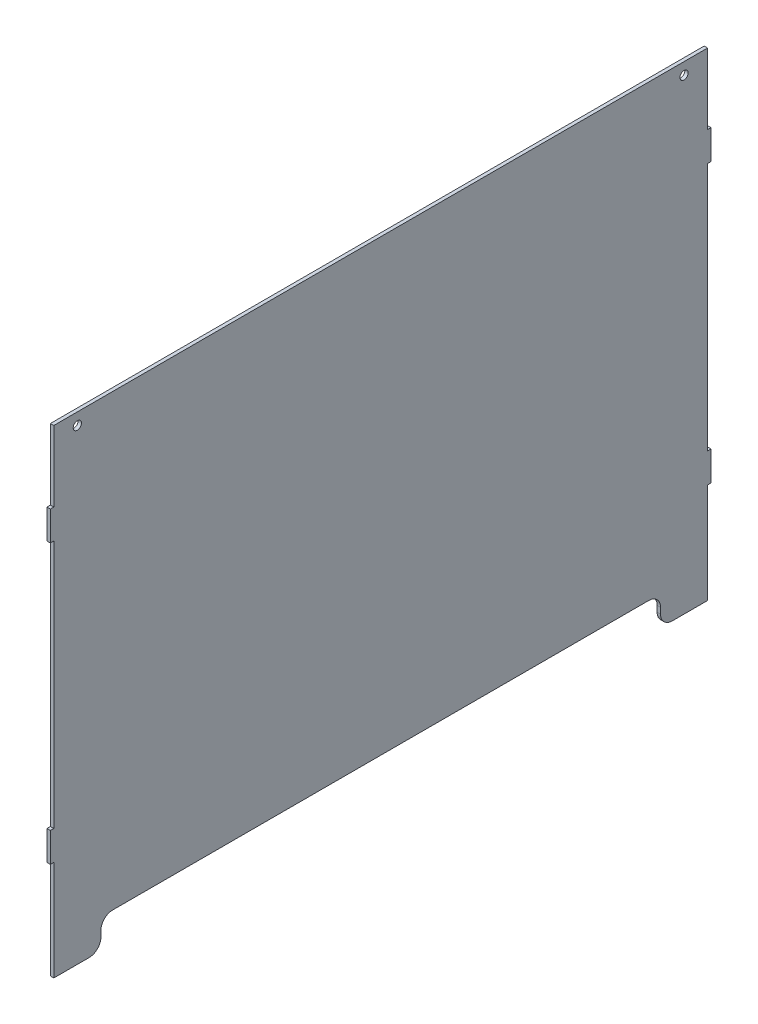
ISO-10303-21;
HEADER;
FILE_DESCRIPTION(('STEP AP214'),'2;1');
FILE_NAME('part.step','',(''),(''),'','','');
FILE_SCHEMA(('AUTOMOTIVE_DESIGN { 1 0 10303 214 1 1 1 1 }'));
ENDSEC;
DATA;
#1=APPLICATION_CONTEXT('core data for automotive mechanical design processes');
#2=APPLICATION_PROTOCOL_DEFINITION('international standard','automotive_design',2000,#1);
#3=PRODUCT_CONTEXT('',#1,'mechanical');
#4=PRODUCT('Part','Part','',(#3));
#5=PRODUCT_RELATED_PRODUCT_CATEGORY('part','',(#4));
#6=PRODUCT_DEFINITION_FORMATION('','',#4);
#7=PRODUCT_DEFINITION_CONTEXT('part definition',#1,'design');
#8=PRODUCT_DEFINITION('design','',#6,#7);
#9=PRODUCT_DEFINITION_SHAPE('','',#8);
#10=(LENGTH_UNIT() NAMED_UNIT(*) SI_UNIT(.MILLI.,.METRE.));
#11=(NAMED_UNIT(*) PLANE_ANGLE_UNIT() SI_UNIT($,.RADIAN.));
#12=(NAMED_UNIT(*) SI_UNIT($,.STERADIAN.) SOLID_ANGLE_UNIT());
#13=UNCERTAINTY_MEASURE_WITH_UNIT(LENGTH_MEASURE(1.E-05),#10,'distance_accuracy_value','');
#14=(GEOMETRIC_REPRESENTATION_CONTEXT(3) GLOBAL_UNCERTAINTY_ASSIGNED_CONTEXT((#13)) GLOBAL_UNIT_ASSIGNED_CONTEXT((#10,
#11,#12)) REPRESENTATION_CONTEXT('',''));
#15=CARTESIAN_POINT('',(0.,0.,0.));
#16=DIRECTION('',(0.,0.,1.));
#17=DIRECTION('',(1.,0.,0.));
#18=AXIS2_PLACEMENT_3D('',#15,#16,#17);
#19=CARTESIAN_POINT('',(2.9,143.2,-277.65));
#20=DIRECTION('',(0.,0.,1.));
#21=DIRECTION('',(1.,0.,0.));
#22=AXIS2_PLACEMENT_3D('',#19,#20,#21);
#23=PLANE('',#22);
#24=DIRECTION('',(0.,1.,0.));
#25=VECTOR('',#24,1.);
#26=CARTESIAN_POINT('',(0.,143.2,-277.65));
#27=LINE('',#26,#25);
#28=CARTESIAN_POINT('',(0.,143.2,-277.65));
#29=VERTEX_POINT('',#28);
#30=CARTESIAN_POINT('',(0.,203.2,-277.65));
#31=VERTEX_POINT('',#30);
#32=EDGE_CURVE('E252',#29,#31,#27,.T.);
#33=ORIENTED_EDGE('',*,*,#32,.T.);
#34=DIRECTION('',(-1.,0.,0.));
#35=VECTOR('',#34,1.);
#36=CARTESIAN_POINT('',(2.9,203.2,-277.65));
#37=LINE('',#36,#35);
#38=CARTESIAN_POINT('',(2.9,203.2,-277.65));
#39=VERTEX_POINT('',#38);
#40=EDGE_CURVE('E11',#39,#31,#37,.T.);
#41=ORIENTED_EDGE('',*,*,#40,.F.);
#42=DIRECTION('',(0.,1.,0.));
#43=VECTOR('',#42,1.);
#44=CARTESIAN_POINT('',(2.9,143.2,-277.65));
#45=LINE('',#44,#43);
#46=CARTESIAN_POINT('',(2.9,143.2,-277.65));
#47=VERTEX_POINT('',#46);
#48=EDGE_CURVE('E307',#47,#39,#45,.T.);
#49=ORIENTED_EDGE('',*,*,#48,.F.);
#50=DIRECTION('',(-1.,0.,0.));
#51=VECTOR('',#50,1.);
#52=CARTESIAN_POINT('',(2.9,143.2,-277.65));
#53=LINE('',#52,#51);
#54=EDGE_CURVE('E248',#47,#29,#53,.T.);
#55=ORIENTED_EDGE('',*,*,#54,.T.);
#56=EDGE_LOOP('',(#33,#41,#49,#55));
#57=FACE_BOUND('',#56,.T.);
#58=ADVANCED_FACE('F36',(#57),#23,.F.);
#59=CARTESIAN_POINT('',(2.9,203.2,277.65));
#60=DIRECTION('',(0.,-1.,0.));
#61=DIRECTION('',(0.,0.,-1.));
#62=AXIS2_PLACEMENT_3D('',#59,#60,#61);
#63=PLANE('',#62);
#64=DIRECTION('',(0.,0.,1.));
#65=VECTOR('',#64,1.);
#66=CARTESIAN_POINT('',(0.,203.2,277.65));
#67=LINE('',#66,#65);
#68=CARTESIAN_POINT('',(0.,203.2,277.65));
#69=VERTEX_POINT('',#68);
#70=EDGE_CURVE('E255',#31,#69,#67,.T.);
#71=ORIENTED_EDGE('',*,*,#70,.T.);
#72=DIRECTION('',(-1.,0.,0.));
#73=VECTOR('',#72,1.);
#74=CARTESIAN_POINT('',(2.9,203.2,277.65));
#75=LINE('',#74,#73);
#76=CARTESIAN_POINT('',(2.9,203.2,277.65));
#77=VERTEX_POINT('',#76);
#78=EDGE_CURVE('E44',#77,#69,#75,.T.);
#79=ORIENTED_EDGE('',*,*,#78,.F.);
#80=DIRECTION('',(0.,0.,1.));
#81=VECTOR('',#80,1.);
#82=CARTESIAN_POINT('',(2.9,203.2,277.65));
#83=LINE('',#82,#81);
#84=EDGE_CURVE('E155',#39,#77,#83,.T.);
#85=ORIENTED_EDGE('',*,*,#84,.F.);
#86=ORIENTED_EDGE('',*,*,#40,.T.);
#87=EDGE_LOOP('',(#71,#79,#85,#86));
#88=FACE_BOUND('',#87,.T.);
#89=ADVANCED_FACE('F466',(#88),#63,.F.);
#90=CARTESIAN_POINT('',(2.9,143.2,277.65));
#91=DIRECTION('',(0.,0.,-1.));
#92=DIRECTION('',(-1.,0.,0.));
#93=AXIS2_PLACEMENT_3D('',#90,#91,#92);
#94=PLANE('',#93);
#95=DIRECTION('',(0.,-1.,0.));
#96=VECTOR('',#95,1.);
#97=CARTESIAN_POINT('',(0.,143.2,277.65));
#98=LINE('',#97,#96);
#99=CARTESIAN_POINT('',(0.,143.2,277.65));
#100=VERTEX_POINT('',#99);
#101=EDGE_CURVE('E258',#69,#100,#98,.T.);
#102=ORIENTED_EDGE('',*,*,#101,.T.);
#103=DIRECTION('',(-1.,0.,0.));
#104=VECTOR('',#103,1.);
#105=CARTESIAN_POINT('',(2.9,143.2,277.65));
#106=LINE('',#105,#104);
#107=CARTESIAN_POINT('',(2.9,143.2,277.65));
#108=VERTEX_POINT('',#107);
#109=EDGE_CURVE('E374',#108,#100,#106,.T.);
#110=ORIENTED_EDGE('',*,*,#109,.F.);
#111=DIRECTION('',(0.,-1.,0.));
#112=VECTOR('',#111,1.);
#113=CARTESIAN_POINT('',(2.9,143.2,277.65));
#114=LINE('',#113,#112);
#115=EDGE_CURVE('E382',#77,#108,#114,.T.);
#116=ORIENTED_EDGE('',*,*,#115,.F.);
#117=ORIENTED_EDGE('',*,*,#78,.T.);
#118=EDGE_LOOP('',(#102,#110,#116,#117));
#119=FACE_BOUND('',#118,.T.);
#120=ADVANCED_FACE('F380',(#119),#94,.F.);
#121=CARTESIAN_POINT('',(2.9,143.2,277.65));
#122=DIRECTION('',(0.,-1.,0.));
#123=DIRECTION('',(0.,0.,-1.));
#124=AXIS2_PLACEMENT_3D('',#121,#122,#123);
#125=PLANE('',#124);
#126=DIRECTION('',(0.,0.,1.));
#127=VECTOR('',#126,1.);
#128=CARTESIAN_POINT('',(0.,143.2,277.65));
#129=LINE('',#128,#127);
#130=CARTESIAN_POINT('',(0.,143.2,280.55));
#131=VERTEX_POINT('',#130);
#132=EDGE_CURVE('E260',#100,#131,#129,.T.);
#133=ORIENTED_EDGE('',*,*,#132,.T.);
#134=DIRECTION('',(-1.,0.,0.));
#135=VECTOR('',#134,1.);
#136=CARTESIAN_POINT('',(2.9,143.2,280.55));
#137=LINE('',#136,#135);
#138=CARTESIAN_POINT('',(2.9,143.2,280.55));
#139=VERTEX_POINT('',#138);
#140=EDGE_CURVE('E371',#139,#131,#137,.T.);
#141=ORIENTED_EDGE('',*,*,#140,.F.);
#142=DIRECTION('',(0.,0.,1.));
#143=VECTOR('',#142,1.);
#144=CARTESIAN_POINT('',(2.9,143.2,277.65));
#145=LINE('',#144,#143);
#146=EDGE_CURVE('E400',#108,#139,#145,.T.);
#147=ORIENTED_EDGE('',*,*,#146,.F.);
#148=ORIENTED_EDGE('',*,*,#109,.T.);
#149=EDGE_LOOP('',(#133,#141,#147,#148));
#150=FACE_BOUND('',#149,.T.);
#151=ADVANCED_FACE('F391',(#150),#125,.F.);
#152=CARTESIAN_POINT('',(2.9,143.2,280.55));
#153=DIRECTION('',(0.,0.,-1.));
#154=DIRECTION('',(-1.,0.,0.));
#155=AXIS2_PLACEMENT_3D('',#152,#153,#154);
#156=PLANE('',#155);
#157=DIRECTION('',(0.,-1.,0.));
#158=VECTOR('',#157,1.);
#159=CARTESIAN_POINT('',(0.,143.2,280.55));
#160=LINE('',#159,#158);
#161=CARTESIAN_POINT('',(0.,118.2,280.55));
#162=VERTEX_POINT('',#161);
#163=EDGE_CURVE('E262',#131,#162,#160,.T.);
#164=ORIENTED_EDGE('',*,*,#163,.T.);
#165=DIRECTION('',(-1.,0.,0.));
#166=VECTOR('',#165,1.);
#167=CARTESIAN_POINT('',(2.9,118.2,280.55));
#168=LINE('',#167,#166);
#169=CARTESIAN_POINT('',(2.9,118.2,280.55));
#170=VERTEX_POINT('',#169);
#171=EDGE_CURVE('E368',#170,#162,#168,.T.);
#172=ORIENTED_EDGE('',*,*,#171,.F.);
#173=DIRECTION('',(0.,-1.,0.));
#174=VECTOR('',#173,1.);
#175=CARTESIAN_POINT('',(2.9,143.2,280.55));
#176=LINE('',#175,#174);
#177=EDGE_CURVE('E397',#139,#170,#176,.T.);
#178=ORIENTED_EDGE('',*,*,#177,.F.);
#179=ORIENTED_EDGE('',*,*,#140,.T.);
#180=EDGE_LOOP('',(#164,#172,#178,#179));
#181=FACE_BOUND('',#180,.T.);
#182=ADVANCED_FACE('F395',(#181),#156,.F.);
#183=CARTESIAN_POINT('',(2.9,118.2,277.65));
#184=DIRECTION('',(0.,1.,0.));
#185=DIRECTION('',(0.,0.,1.));
#186=AXIS2_PLACEMENT_3D('',#183,#184,#185);
#187=PLANE('',#186);
#188=DIRECTION('',(0.,0.,-1.));
#189=VECTOR('',#188,1.);
#190=CARTESIAN_POINT('',(0.,118.2,277.65));
#191=LINE('',#190,#189);
#192=CARTESIAN_POINT('',(0.,118.2,277.65));
#193=VERTEX_POINT('',#192);
#194=EDGE_CURVE('E264',#162,#193,#191,.T.);
#195=ORIENTED_EDGE('',*,*,#194,.T.);
#196=DIRECTION('',(-1.,0.,0.));
#197=VECTOR('',#196,1.);
#198=CARTESIAN_POINT('',(2.9,118.2,277.65));
#199=LINE('',#198,#197);
#200=CARTESIAN_POINT('',(2.9,118.2,277.65));
#201=VERTEX_POINT('',#200);
#202=EDGE_CURVE('E365',#201,#193,#199,.T.);
#203=ORIENTED_EDGE('',*,*,#202,.F.);
#204=DIRECTION('',(0.,0.,-1.));
#205=VECTOR('',#204,1.);
#206=CARTESIAN_POINT('',(2.9,118.2,277.65));
#207=LINE('',#206,#205);
#208=EDGE_CURVE('E399',#170,#201,#207,.T.);
#209=ORIENTED_EDGE('',*,*,#208,.F.);
#210=ORIENTED_EDGE('',*,*,#171,.T.);
#211=EDGE_LOOP('',(#195,#203,#209,#210));
#212=FACE_BOUND('',#211,.T.);
#213=ADVANCED_FACE('F479',(#212),#187,.F.);
#214=CARTESIAN_POINT('',(2.9,-93.1999999999999,277.65));
#215=DIRECTION('',(0.,0.,-1.));
#216=DIRECTION('',(0.,1.,0.));
#217=AXIS2_PLACEMENT_3D('',#214,#215,#216);
#218=PLANE('',#217);
#219=DIRECTION('',(0.,-1.,0.));
#220=VECTOR('',#219,1.);
#221=CARTESIAN_POINT('',(0.,-93.1999999999999,277.65));
#222=LINE('',#221,#220);
#223=CARTESIAN_POINT('',(0.,-93.1999999999999,277.65));
#224=VERTEX_POINT('',#223);
#225=EDGE_CURVE('E266',#193,#224,#222,.T.);
#226=ORIENTED_EDGE('',*,*,#225,.T.);
#227=DIRECTION('',(-1.,0.,0.));
#228=VECTOR('',#227,1.);
#229=CARTESIAN_POINT('',(2.9,-93.1999999999999,277.65));
#230=LINE('',#229,#228);
#231=CARTESIAN_POINT('',(2.9,-93.1999999999999,277.65));
#232=VERTEX_POINT('',#231);
#233=EDGE_CURVE('E362',#232,#224,#230,.T.);
#234=ORIENTED_EDGE('',*,*,#233,.F.);
#235=DIRECTION('',(0.,-1.,0.));
#236=VECTOR('',#235,1.);
#237=CARTESIAN_POINT('',(2.9,-93.1999999999999,277.65));
#238=LINE('',#237,#236);
#239=EDGE_CURVE('E402',#201,#232,#238,.T.);
#240=ORIENTED_EDGE('',*,*,#239,.F.);
#241=ORIENTED_EDGE('',*,*,#202,.T.);
#242=EDGE_LOOP('',(#226,#234,#240,#241));
#243=FACE_BOUND('',#242,.T.);
#244=ADVANCED_FACE('F482',(#243),#218,.F.);
#245=CARTESIAN_POINT('',(2.9,-93.1999999999999,277.65));
#246=DIRECTION('',(0.,-1.,0.));
#247=DIRECTION('',(0.,0.,-1.));
#248=AXIS2_PLACEMENT_3D('',#245,#246,#247);
#249=PLANE('',#248);
#250=DIRECTION('',(0.,0.,1.));
#251=VECTOR('',#250,1.);
#252=CARTESIAN_POINT('',(0.,-93.1999999999999,277.65));
#253=LINE('',#252,#251);
#254=CARTESIAN_POINT('',(0.,-93.1999999999999,280.55));
#255=VERTEX_POINT('',#254);
#256=EDGE_CURVE('E268',#224,#255,#253,.T.);
#257=ORIENTED_EDGE('',*,*,#256,.T.);
#258=DIRECTION('',(-1.,0.,0.));
#259=VECTOR('',#258,1.);
#260=CARTESIAN_POINT('',(2.9,-93.1999999999999,280.55));
#261=LINE('',#260,#259);
#262=CARTESIAN_POINT('',(2.9,-93.1999999999999,280.55));
#263=VERTEX_POINT('',#262);
#264=EDGE_CURVE('E359',#263,#255,#261,.T.);
#265=ORIENTED_EDGE('',*,*,#264,.F.);
#266=DIRECTION('',(0.,0.,1.));
#267=VECTOR('',#266,1.);
#268=CARTESIAN_POINT('',(2.9,-93.1999999999999,277.65));
#269=LINE('',#268,#267);
#270=EDGE_CURVE('E408',#232,#263,#269,.T.);
#271=ORIENTED_EDGE('',*,*,#270,.F.);
#272=ORIENTED_EDGE('',*,*,#233,.T.);
#273=EDGE_LOOP('',(#257,#265,#271,#272));
#274=FACE_BOUND('',#273,.T.);
#275=ADVANCED_FACE('F486',(#274),#249,.F.);
#276=CARTESIAN_POINT('',(2.9,-93.1999999999999,280.55));
#277=DIRECTION('',(0.,0.,-1.));
#278=DIRECTION('',(0.,1.,0.));
#279=AXIS2_PLACEMENT_3D('',#276,#277,#278);
#280=PLANE('',#279);
#281=DIRECTION('',(0.,-1.,0.));
#282=VECTOR('',#281,1.);
#283=CARTESIAN_POINT('',(0.,-93.1999999999999,280.55));
#284=LINE('',#283,#282);
#285=CARTESIAN_POINT('',(0.,-118.2,280.55));
#286=VERTEX_POINT('',#285);
#287=EDGE_CURVE('E270',#255,#286,#284,.T.);
#288=ORIENTED_EDGE('',*,*,#287,.T.);
#289=DIRECTION('',(-1.,0.,0.));
#290=VECTOR('',#289,1.);
#291=CARTESIAN_POINT('',(2.9,-118.2,280.55));
#292=LINE('',#291,#290);
#293=CARTESIAN_POINT('',(2.9,-118.2,280.55));
#294=VERTEX_POINT('',#293);
#295=EDGE_CURVE('E356',#294,#286,#292,.T.);
#296=ORIENTED_EDGE('',*,*,#295,.F.);
#297=DIRECTION('',(0.,-1.,0.));
#298=VECTOR('',#297,1.);
#299=CARTESIAN_POINT('',(2.9,-93.1999999999999,280.55));
#300=LINE('',#299,#298);
#301=EDGE_CURVE('E410',#263,#294,#300,.T.);
#302=ORIENTED_EDGE('',*,*,#301,.F.);
#303=ORIENTED_EDGE('',*,*,#264,.T.);
#304=EDGE_LOOP('',(#288,#296,#302,#303));
#305=FACE_BOUND('',#304,.T.);
#306=ADVANCED_FACE('F490',(#305),#280,.F.);
#307=CARTESIAN_POINT('',(2.9,-118.2,277.65));
#308=DIRECTION('',(0.,1.,0.));
#309=DIRECTION('',(0.,0.,1.));
#310=AXIS2_PLACEMENT_3D('',#307,#308,#309);
#311=PLANE('',#310);
#312=DIRECTION('',(0.,0.,-1.));
#313=VECTOR('',#312,1.);
#314=CARTESIAN_POINT('',(0.,-118.2,277.65));
#315=LINE('',#314,#313);
#316=CARTESIAN_POINT('',(0.,-118.2,277.65));
#317=VERTEX_POINT('',#316);
#318=EDGE_CURVE('E272',#286,#317,#315,.T.);
#319=ORIENTED_EDGE('',*,*,#318,.T.);
#320=DIRECTION('',(-1.,0.,0.));
#321=VECTOR('',#320,1.);
#322=CARTESIAN_POINT('',(2.9,-118.2,277.65));
#323=LINE('',#322,#321);
#324=CARTESIAN_POINT('',(2.9,-118.2,277.65));
#325=VERTEX_POINT('',#324);
#326=EDGE_CURVE('E353',#325,#317,#323,.T.);
#327=ORIENTED_EDGE('',*,*,#326,.F.);
#328=DIRECTION('',(0.,0.,-1.));
#329=VECTOR('',#328,1.);
#330=CARTESIAN_POINT('',(2.9,-118.2,277.65));
#331=LINE('',#330,#329);
#332=EDGE_CURVE('E412',#294,#325,#331,.T.);
#333=ORIENTED_EDGE('',*,*,#332,.F.);
#334=ORIENTED_EDGE('',*,*,#295,.T.);
#335=EDGE_LOOP('',(#319,#327,#333,#334));
#336=FACE_BOUND('',#335,.T.);
#337=ADVANCED_FACE('F494',(#336),#311,.F.);
#338=CARTESIAN_POINT('',(2.9,-203.2,277.65));
#339=DIRECTION('',(0.,0.,-1.));
#340=DIRECTION('',(0.,1.,0.));
#341=AXIS2_PLACEMENT_3D('',#338,#339,#340);
#342=PLANE('',#341);
#343=DIRECTION('',(0.,-1.,0.));
#344=VECTOR('',#343,1.);
#345=CARTESIAN_POINT('',(0.,-203.2,277.65));
#346=LINE('',#345,#344);
#347=CARTESIAN_POINT('',(0.,-203.2,277.65));
#348=VERTEX_POINT('',#347);
#349=EDGE_CURVE('E274',#317,#348,#346,.T.);
#350=ORIENTED_EDGE('',*,*,#349,.T.);
#351=DIRECTION('',(-1.,0.,0.));
#352=VECTOR('',#351,1.);
#353=CARTESIAN_POINT('',(2.9,-203.2,277.65));
#354=LINE('',#353,#352);
#355=CARTESIAN_POINT('',(2.9,-203.2,277.65));
#356=VERTEX_POINT('',#355);
#357=EDGE_CURVE('E350',#356,#348,#354,.T.);
#358=ORIENTED_EDGE('',*,*,#357,.F.);
#359=DIRECTION('',(0.,-1.,0.));
#360=VECTOR('',#359,1.);
#361=CARTESIAN_POINT('',(2.9,-203.2,277.65));
#362=LINE('',#361,#360);
#363=EDGE_CURVE('E414',#325,#356,#362,.T.);
#364=ORIENTED_EDGE('',*,*,#363,.F.);
#365=ORIENTED_EDGE('',*,*,#326,.T.);
#366=EDGE_LOOP('',(#350,#358,#364,#365));
#367=FACE_BOUND('',#366,.T.);
#368=ADVANCED_FACE('F498',(#367),#342,.F.);
#369=CARTESIAN_POINT('',(2.9,-203.2,277.65));
#370=DIRECTION('',(0.,1.,0.));
#371=DIRECTION('',(0.,0.,1.));
#372=AXIS2_PLACEMENT_3D('',#369,#370,#371);
#373=PLANE('',#372);
#374=DIRECTION('',(0.,0.,-1.));
#375=VECTOR('',#374,1.);
#376=CARTESIAN_POINT('',(0.,-203.2,277.65));
#377=LINE('',#376,#375);
#378=CARTESIAN_POINT('',(0.,-203.2,247.65));
#379=VERTEX_POINT('',#378);
#380=EDGE_CURVE('E276',#348,#379,#377,.T.);
#381=ORIENTED_EDGE('',*,*,#380,.T.);
#382=DIRECTION('',(-1.,0.,0.));
#383=VECTOR('',#382,1.);
#384=CARTESIAN_POINT('',(2.9,-203.2,247.65));
#385=LINE('',#384,#383);
#386=CARTESIAN_POINT('',(2.9,-203.2,247.65));
#387=VERTEX_POINT('',#386);
#388=EDGE_CURVE('E347',#387,#379,#385,.T.);
#389=ORIENTED_EDGE('',*,*,#388,.F.);
#390=DIRECTION('',(0.,0.,-1.));
#391=VECTOR('',#390,1.);
#392=CARTESIAN_POINT('',(2.9,-203.2,277.65));
#393=LINE('',#392,#391);
#394=EDGE_CURVE('E416',#356,#387,#393,.T.);
#395=ORIENTED_EDGE('',*,*,#394,.F.);
#396=ORIENTED_EDGE('',*,*,#357,.T.);
#397=EDGE_LOOP('',(#381,#389,#395,#396));
#398=FACE_BOUND('',#397,.T.);
#399=ADVANCED_FACE('F502',(#398),#373,.F.);
#400=CARTESIAN_POINT('',(2.9,-193.2,247.65));
#401=DIRECTION('',(-1.,0.,0.));
#402=DIRECTION('',(0.,0.,1.));
#403=AXIS2_PLACEMENT_3D('',#400,#401,#402);
#404=CYLINDRICAL_SURFACE('',#403,10.);
#405=CARTESIAN_POINT('',(0.,-193.2,247.65));
#406=DIRECTION('',(1.,0.,0.));
#407=DIRECTION('',(0.,0.,1.));
#408=AXIS2_PLACEMENT_3D('',#405,#406,#407);
#409=CIRCLE('',#408,10.);
#410=CARTESIAN_POINT('',(0.,-193.2,237.65));
#411=VERTEX_POINT('',#410);
#412=EDGE_CURVE('E278',#379,#411,#409,.T.);
#413=ORIENTED_EDGE('',*,*,#412,.T.);
#414=DIRECTION('',(-1.,0.,0.));
#415=VECTOR('',#414,1.);
#416=CARTESIAN_POINT('',(2.9,-193.2,237.65));
#417=LINE('',#416,#415);
#418=CARTESIAN_POINT('',(2.9,-193.2,237.65));
#419=VERTEX_POINT('',#418);
#420=EDGE_CURVE('E344',#419,#411,#417,.T.);
#421=ORIENTED_EDGE('',*,*,#420,.F.);
#422=CARTESIAN_POINT('',(2.9,-193.2,247.65));
#423=DIRECTION('',(1.,0.,0.));
#424=DIRECTION('',(0.,0.,1.));
#425=AXIS2_PLACEMENT_3D('',#422,#423,#424);
#426=CIRCLE('',#425,10.);
#427=EDGE_CURVE('E418',#387,#419,#426,.T.);
#428=ORIENTED_EDGE('',*,*,#427,.F.);
#429=ORIENTED_EDGE('',*,*,#388,.T.);
#430=EDGE_LOOP('',(#413,#421,#428,#429));
#431=FACE_BOUND('',#430,.T.);
#432=ADVANCED_FACE('F506',(#431),#404,.T.);
#433=CARTESIAN_POINT('',(2.9,-193.2,237.65));
#434=DIRECTION('',(0.,0.,1.));
#435=DIRECTION('',(1.,0.,0.));
#436=AXIS2_PLACEMENT_3D('',#433,#434,#435);
#437=PLANE('',#436);
#438=DIRECTION('',(0.,1.,0.));
#439=VECTOR('',#438,1.);
#440=CARTESIAN_POINT('',(0.,-193.2,237.65));
#441=LINE('',#440,#439);
#442=CARTESIAN_POINT('',(0.,-188.2,237.65));
#443=VERTEX_POINT('',#442);
#444=EDGE_CURVE('E280',#411,#443,#441,.T.);
#445=ORIENTED_EDGE('',*,*,#444,.T.);
#446=DIRECTION('',(-1.,0.,0.));
#447=VECTOR('',#446,1.);
#448=CARTESIAN_POINT('',(2.9,-188.2,237.65));
#449=LINE('',#448,#447);
#450=CARTESIAN_POINT('',(2.9,-188.2,237.65));
#451=VERTEX_POINT('',#450);
#452=EDGE_CURVE('E341',#451,#443,#449,.T.);
#453=ORIENTED_EDGE('',*,*,#452,.F.);
#454=DIRECTION('',(0.,1.,0.));
#455=VECTOR('',#454,1.);
#456=CARTESIAN_POINT('',(2.9,-193.2,237.65));
#457=LINE('',#456,#455);
#458=EDGE_CURVE('E420',#419,#451,#457,.T.);
#459=ORIENTED_EDGE('',*,*,#458,.F.);
#460=ORIENTED_EDGE('',*,*,#420,.T.);
#461=EDGE_LOOP('',(#445,#453,#459,#460));
#462=FACE_BOUND('',#461,.T.);
#463=ADVANCED_FACE('F510',(#462),#437,.F.);
#464=CARTESIAN_POINT('',(2.9,-188.2,227.65));
#465=DIRECTION('',(-1.,0.,0.));
#466=DIRECTION('',(0.,0.,1.));
#467=AXIS2_PLACEMENT_3D('',#464,#465,#466);
#468=CYLINDRICAL_SURFACE('',#467,10.);
#469=CARTESIAN_POINT('',(0.,-188.2,227.65));
#470=DIRECTION('',(-1.,0.,0.));
#471=DIRECTION('',(0.,0.,-1.));
#472=AXIS2_PLACEMENT_3D('',#469,#470,#471);
#473=CIRCLE('',#472,10.);
#474=CARTESIAN_POINT('',(0.,-178.2,227.65));
#475=VERTEX_POINT('',#474);
#476=EDGE_CURVE('E282',#443,#475,#473,.T.);
#477=ORIENTED_EDGE('',*,*,#476,.T.);
#478=DIRECTION('',(-1.,0.,0.));
#479=VECTOR('',#478,1.);
#480=CARTESIAN_POINT('',(2.9,-178.2,227.65));
#481=LINE('',#480,#479);
#482=CARTESIAN_POINT('',(2.9,-178.2,227.65));
#483=VERTEX_POINT('',#482);
#484=EDGE_CURVE('E338',#483,#475,#481,.T.);
#485=ORIENTED_EDGE('',*,*,#484,.F.);
#486=CARTESIAN_POINT('',(2.9,-188.2,227.65));
#487=DIRECTION('',(-1.,0.,0.));
#488=DIRECTION('',(0.,0.,-1.));
#489=AXIS2_PLACEMENT_3D('',#486,#487,#488);
#490=CIRCLE('',#489,10.);
#491=EDGE_CURVE('E422',#451,#483,#490,.T.);
#492=ORIENTED_EDGE('',*,*,#491,.F.);
#493=ORIENTED_EDGE('',*,*,#452,.T.);
#494=EDGE_LOOP('',(#477,#485,#492,#493));
#495=FACE_BOUND('',#494,.T.);
#496=ADVANCED_FACE('F514',(#495),#468,.F.);
#497=CARTESIAN_POINT('',(2.9,-178.2,227.65));
#498=DIRECTION('',(0.,1.,0.));
#499=DIRECTION('',(0.,0.,1.));
#500=AXIS2_PLACEMENT_3D('',#497,#498,#499);
#501=PLANE('',#500);
#502=DIRECTION('',(0.,0.,-1.));
#503=VECTOR('',#502,1.);
#504=CARTESIAN_POINT('',(0.,-178.2,227.65));
#505=LINE('',#504,#503);
#506=CARTESIAN_POINT('',(0.,-178.2,-227.65));
#507=VERTEX_POINT('',#506);
#508=EDGE_CURVE('E284',#475,#507,#505,.T.);
#509=ORIENTED_EDGE('',*,*,#508,.T.);
#510=DIRECTION('',(-1.,0.,0.));
#511=VECTOR('',#510,1.);
#512=CARTESIAN_POINT('',(2.9,-178.2,-227.65));
#513=LINE('',#512,#511);
#514=CARTESIAN_POINT('',(2.9,-178.2,-227.65));
#515=VERTEX_POINT('',#514);
#516=EDGE_CURVE('E335',#515,#507,#513,.T.);
#517=ORIENTED_EDGE('',*,*,#516,.F.);
#518=DIRECTION('',(0.,0.,-1.));
#519=VECTOR('',#518,1.);
#520=CARTESIAN_POINT('',(2.9,-178.2,227.65));
#521=LINE('',#520,#519);
#522=EDGE_CURVE('E424',#483,#515,#521,.T.);
#523=ORIENTED_EDGE('',*,*,#522,.F.);
#524=ORIENTED_EDGE('',*,*,#484,.T.);
#525=EDGE_LOOP('',(#509,#517,#523,#524));
#526=FACE_BOUND('',#525,.T.);
#527=ADVANCED_FACE('F518',(#526),#501,.F.);
#528=CARTESIAN_POINT('',(2.9,-188.2,-227.65));
#529=DIRECTION('',(-1.,0.,0.));
#530=DIRECTION('',(0.,0.,1.));
#531=AXIS2_PLACEMENT_3D('',#528,#529,#530);
#532=CYLINDRICAL_SURFACE('',#531,10.);
#533=CARTESIAN_POINT('',(0.,-188.2,-227.65));
#534=DIRECTION('',(-1.,0.,0.));
#535=DIRECTION('',(0.,0.,-1.));
#536=AXIS2_PLACEMENT_3D('',#533,#534,#535);
#537=CIRCLE('',#536,10.);
#538=CARTESIAN_POINT('',(0.,-188.2,-237.65));
#539=VERTEX_POINT('',#538);
#540=EDGE_CURVE('E286',#507,#539,#537,.T.);
#541=ORIENTED_EDGE('',*,*,#540,.T.);
#542=DIRECTION('',(-1.,0.,0.));
#543=VECTOR('',#542,1.);
#544=CARTESIAN_POINT('',(2.9,-188.2,-237.65));
#545=LINE('',#544,#543);
#546=CARTESIAN_POINT('',(2.9,-188.2,-237.65));
#547=VERTEX_POINT('',#546);
#548=EDGE_CURVE('E332',#547,#539,#545,.T.);
#549=ORIENTED_EDGE('',*,*,#548,.F.);
#550=CARTESIAN_POINT('',(2.9,-188.2,-227.65));
#551=DIRECTION('',(-1.,0.,0.));
#552=DIRECTION('',(0.,0.,-1.));
#553=AXIS2_PLACEMENT_3D('',#550,#551,#552);
#554=CIRCLE('',#553,10.);
#555=EDGE_CURVE('E426',#515,#547,#554,.T.);
#556=ORIENTED_EDGE('',*,*,#555,.F.);
#557=ORIENTED_EDGE('',*,*,#516,.T.);
#558=EDGE_LOOP('',(#541,#549,#556,#557));
#559=FACE_BOUND('',#558,.T.);
#560=ADVANCED_FACE('F522',(#559),#532,.F.);
#561=CARTESIAN_POINT('',(2.9,-193.2,-237.65));
#562=DIRECTION('',(0.,0.,-1.));
#563=DIRECTION('',(-1.,0.,0.));
#564=AXIS2_PLACEMENT_3D('',#561,#562,#563);
#565=PLANE('',#564);
#566=DIRECTION('',(0.,-1.,0.));
#567=VECTOR('',#566,1.);
#568=CARTESIAN_POINT('',(0.,-193.2,-237.65));
#569=LINE('',#568,#567);
#570=CARTESIAN_POINT('',(0.,-193.2,-237.65));
#571=VERTEX_POINT('',#570);
#572=EDGE_CURVE('E288',#539,#571,#569,.T.);
#573=ORIENTED_EDGE('',*,*,#572,.T.);
#574=DIRECTION('',(-1.,0.,0.));
#575=VECTOR('',#574,1.);
#576=CARTESIAN_POINT('',(2.9,-193.2,-237.65));
#577=LINE('',#576,#575);
#578=CARTESIAN_POINT('',(2.9,-193.2,-237.65));
#579=VERTEX_POINT('',#578);
#580=EDGE_CURVE('E329',#579,#571,#577,.T.);
#581=ORIENTED_EDGE('',*,*,#580,.F.);
#582=DIRECTION('',(0.,-1.,0.));
#583=VECTOR('',#582,1.);
#584=CARTESIAN_POINT('',(2.9,-193.2,-237.65));
#585=LINE('',#584,#583);
#586=EDGE_CURVE('E428',#547,#579,#585,.T.);
#587=ORIENTED_EDGE('',*,*,#586,.F.);
#588=ORIENTED_EDGE('',*,*,#548,.T.);
#589=EDGE_LOOP('',(#573,#581,#587,#588));
#590=FACE_BOUND('',#589,.T.);
#591=ADVANCED_FACE('F526',(#590),#565,.F.);
#592=CARTESIAN_POINT('',(2.9,-193.2,-247.65));
#593=DIRECTION('',(-1.,0.,0.));
#594=DIRECTION('',(0.,0.,1.));
#595=AXIS2_PLACEMENT_3D('',#592,#593,#594);
#596=CYLINDRICAL_SURFACE('',#595,10.);
#597=CARTESIAN_POINT('',(0.,-193.2,-247.65));
#598=DIRECTION('',(1.,0.,0.));
#599=DIRECTION('',(0.,0.,1.));
#600=AXIS2_PLACEMENT_3D('',#597,#598,#599);
#601=CIRCLE('',#600,10.);
#602=CARTESIAN_POINT('',(0.,-203.2,-247.65));
#603=VERTEX_POINT('',#602);
#604=EDGE_CURVE('E290',#571,#603,#601,.T.);
#605=ORIENTED_EDGE('',*,*,#604,.T.);
#606=DIRECTION('',(-1.,0.,0.));
#607=VECTOR('',#606,1.);
#608=CARTESIAN_POINT('',(2.9,-203.2,-247.65));
#609=LINE('',#608,#607);
#610=CARTESIAN_POINT('',(2.9,-203.2,-247.65));
#611=VERTEX_POINT('',#610);
#612=EDGE_CURVE('E326',#611,#603,#609,.T.);
#613=ORIENTED_EDGE('',*,*,#612,.F.);
#614=CARTESIAN_POINT('',(2.9,-193.2,-247.65));
#615=DIRECTION('',(1.,0.,0.));
#616=DIRECTION('',(0.,0.,1.));
#617=AXIS2_PLACEMENT_3D('',#614,#615,#616);
#618=CIRCLE('',#617,10.);
#619=EDGE_CURVE('E430',#579,#611,#618,.T.);
#620=ORIENTED_EDGE('',*,*,#619,.F.);
#621=ORIENTED_EDGE('',*,*,#580,.T.);
#622=EDGE_LOOP('',(#605,#613,#620,#621));
#623=FACE_BOUND('',#622,.T.);
#624=ADVANCED_FACE('F530',(#623),#596,.T.);
#625=CARTESIAN_POINT('',(2.9,-203.2,-247.65));
#626=DIRECTION('',(0.,1.,0.));
#627=DIRECTION('',(0.,0.,1.));
#628=AXIS2_PLACEMENT_3D('',#625,#626,#627);
#629=PLANE('',#628);
#630=DIRECTION('',(0.,0.,-1.));
#631=VECTOR('',#630,1.);
#632=CARTESIAN_POINT('',(0.,-203.2,-247.65));
#633=LINE('',#632,#631);
#634=CARTESIAN_POINT('',(0.,-203.2,-277.65));
#635=VERTEX_POINT('',#634);
#636=EDGE_CURVE('E292',#603,#635,#633,.T.);
#637=ORIENTED_EDGE('',*,*,#636,.T.);
#638=DIRECTION('',(-1.,0.,0.));
#639=VECTOR('',#638,1.);
#640=CARTESIAN_POINT('',(2.9,-203.2,-277.65));
#641=LINE('',#640,#639);
#642=CARTESIAN_POINT('',(2.9,-203.2,-277.65));
#643=VERTEX_POINT('',#642);
#644=EDGE_CURVE('E323',#643,#635,#641,.T.);
#645=ORIENTED_EDGE('',*,*,#644,.F.);
#646=DIRECTION('',(0.,0.,-1.));
#647=VECTOR('',#646,1.);
#648=CARTESIAN_POINT('',(2.9,-203.2,-247.65));
#649=LINE('',#648,#647);
#650=EDGE_CURVE('E432',#611,#643,#649,.T.);
#651=ORIENTED_EDGE('',*,*,#650,.F.);
#652=ORIENTED_EDGE('',*,*,#612,.T.);
#653=EDGE_LOOP('',(#637,#645,#651,#652));
#654=FACE_BOUND('',#653,.T.);
#655=ADVANCED_FACE('F534',(#654),#629,.F.);
#656=CARTESIAN_POINT('',(2.9,-203.2,-277.65));
#657=DIRECTION('',(0.,0.,1.));
#658=DIRECTION('',(1.,0.,0.));
#659=AXIS2_PLACEMENT_3D('',#656,#657,#658);
#660=PLANE('',#659);
#661=DIRECTION('',(0.,1.,0.));
#662=VECTOR('',#661,1.);
#663=CARTESIAN_POINT('',(0.,-203.2,-277.65));
#664=LINE('',#663,#662);
#665=CARTESIAN_POINT('',(0.,-118.2,-277.65));
#666=VERTEX_POINT('',#665);
#667=EDGE_CURVE('E294',#635,#666,#664,.T.);
#668=ORIENTED_EDGE('',*,*,#667,.T.);
#669=DIRECTION('',(-1.,0.,0.));
#670=VECTOR('',#669,1.);
#671=CARTESIAN_POINT('',(2.9,-118.2,-277.65));
#672=LINE('',#671,#670);
#673=CARTESIAN_POINT('',(2.9,-118.2,-277.65));
#674=VERTEX_POINT('',#673);
#675=EDGE_CURVE('E320',#674,#666,#672,.T.);
#676=ORIENTED_EDGE('',*,*,#675,.F.);
#677=DIRECTION('',(0.,1.,0.));
#678=VECTOR('',#677,1.);
#679=CARTESIAN_POINT('',(2.9,-203.2,-277.65));
#680=LINE('',#679,#678);
#681=EDGE_CURVE('E434',#643,#674,#680,.T.);
#682=ORIENTED_EDGE('',*,*,#681,.F.);
#683=ORIENTED_EDGE('',*,*,#644,.T.);
#684=EDGE_LOOP('',(#668,#676,#682,#683));
#685=FACE_BOUND('',#684,.T.);
#686=ADVANCED_FACE('F538',(#685),#660,.F.);
#687=CARTESIAN_POINT('',(2.9,-118.2,-277.65));
#688=DIRECTION('',(0.,1.,0.));
#689=DIRECTION('',(0.,0.,1.));
#690=AXIS2_PLACEMENT_3D('',#687,#688,#689);
#691=PLANE('',#690);
#692=DIRECTION('',(0.,0.,-1.));
#693=VECTOR('',#692,1.);
#694=CARTESIAN_POINT('',(0.,-118.2,-277.65));
#695=LINE('',#694,#693);
#696=CARTESIAN_POINT('',(0.,-118.2,-280.55));
#697=VERTEX_POINT('',#696);
#698=EDGE_CURVE('E296',#666,#697,#695,.T.);
#699=ORIENTED_EDGE('',*,*,#698,.T.);
#700=DIRECTION('',(-1.,0.,0.));
#701=VECTOR('',#700,1.);
#702=CARTESIAN_POINT('',(2.9,-118.2,-280.55));
#703=LINE('',#702,#701);
#704=CARTESIAN_POINT('',(2.9,-118.2,-280.55));
#705=VERTEX_POINT('',#704);
#706=EDGE_CURVE('E317',#705,#697,#703,.T.);
#707=ORIENTED_EDGE('',*,*,#706,.F.);
#708=DIRECTION('',(0.,0.,-1.));
#709=VECTOR('',#708,1.);
#710=CARTESIAN_POINT('',(2.9,-118.2,-277.65));
#711=LINE('',#710,#709);
#712=EDGE_CURVE('E436',#674,#705,#711,.T.);
#713=ORIENTED_EDGE('',*,*,#712,.F.);
#714=ORIENTED_EDGE('',*,*,#675,.T.);
#715=EDGE_LOOP('',(#699,#707,#713,#714));
#716=FACE_BOUND('',#715,.T.);
#717=ADVANCED_FACE('F542',(#716),#691,.F.);
#718=CARTESIAN_POINT('',(2.9,-93.2,-280.55));
#719=DIRECTION('',(0.,0.,1.));
#720=DIRECTION('',(0.,-1.,0.));
#721=AXIS2_PLACEMENT_3D('',#718,#719,#720);
#722=PLANE('',#721);
#723=DIRECTION('',(0.,1.,0.));
#724=VECTOR('',#723,1.);
#725=CARTESIAN_POINT('',(0.,-93.2,-280.55));
#726=LINE('',#725,#724);
#727=CARTESIAN_POINT('',(0.,-93.2,-280.55));
#728=VERTEX_POINT('',#727);
#729=EDGE_CURVE('E298',#697,#728,#726,.T.);
#730=ORIENTED_EDGE('',*,*,#729,.T.);
#731=DIRECTION('',(-1.,0.,0.));
#732=VECTOR('',#731,1.);
#733=CARTESIAN_POINT('',(2.9,-93.2,-280.55));
#734=LINE('',#733,#732);
#735=CARTESIAN_POINT('',(2.9,-93.2,-280.55));
#736=VERTEX_POINT('',#735);
#737=EDGE_CURVE('E314',#736,#728,#734,.T.);
#738=ORIENTED_EDGE('',*,*,#737,.F.);
#739=DIRECTION('',(0.,1.,0.));
#740=VECTOR('',#739,1.);
#741=CARTESIAN_POINT('',(2.9,-93.2,-280.55));
#742=LINE('',#741,#740);
#743=EDGE_CURVE('E438',#705,#736,#742,.T.);
#744=ORIENTED_EDGE('',*,*,#743,.F.);
#745=ORIENTED_EDGE('',*,*,#706,.T.);
#746=EDGE_LOOP('',(#730,#738,#744,#745));
#747=FACE_BOUND('',#746,.T.);
#748=ADVANCED_FACE('F546',(#747),#722,.F.);
#749=CARTESIAN_POINT('',(2.9,-93.2,-277.65));
#750=DIRECTION('',(0.,-1.,0.));
#751=DIRECTION('',(0.,0.,-1.));
#752=AXIS2_PLACEMENT_3D('',#749,#750,#751);
#753=PLANE('',#752);
#754=DIRECTION('',(0.,0.,1.));
#755=VECTOR('',#754,1.);
#756=CARTESIAN_POINT('',(0.,-93.2,-277.65));
#757=LINE('',#756,#755);
#758=CARTESIAN_POINT('',(0.,-93.2,-277.65));
#759=VERTEX_POINT('',#758);
#760=EDGE_CURVE('E300',#728,#759,#757,.T.);
#761=ORIENTED_EDGE('',*,*,#760,.T.);
#762=DIRECTION('',(-1.,0.,0.));
#763=VECTOR('',#762,1.);
#764=CARTESIAN_POINT('',(2.9,-93.2,-277.65));
#765=LINE('',#764,#763);
#766=CARTESIAN_POINT('',(2.9,-93.2,-277.65));
#767=VERTEX_POINT('',#766);
#768=EDGE_CURVE('E311',#767,#759,#765,.T.);
#769=ORIENTED_EDGE('',*,*,#768,.F.);
#770=DIRECTION('',(0.,0.,1.));
#771=VECTOR('',#770,1.);
#772=CARTESIAN_POINT('',(2.9,-93.2,-277.65));
#773=LINE('',#772,#771);
#774=EDGE_CURVE('E440',#736,#767,#773,.T.);
#775=ORIENTED_EDGE('',*,*,#774,.F.);
#776=ORIENTED_EDGE('',*,*,#737,.T.);
#777=EDGE_LOOP('',(#761,#769,#775,#776));
#778=FACE_BOUND('',#777,.T.);
#779=ADVANCED_FACE('F446',(#778),#753,.F.);
#780=CARTESIAN_POINT('',(2.9,-93.2,-277.65));
#781=DIRECTION('',(0.,0.,1.));
#782=DIRECTION('',(1.,0.,0.));
#783=AXIS2_PLACEMENT_3D('',#780,#781,#782);
#784=PLANE('',#783);
#785=DIRECTION('',(0.,1.,0.));
#786=VECTOR('',#785,1.);
#787=CARTESIAN_POINT('',(0.,-93.2,-277.65));
#788=LINE('',#787,#786);
#789=CARTESIAN_POINT('',(0.,118.2,-277.65));
#790=VERTEX_POINT('',#789);
#791=EDGE_CURVE('E302',#759,#790,#788,.T.);
#792=ORIENTED_EDGE('',*,*,#791,.T.);
#793=DIRECTION('',(-1.,0.,0.));
#794=VECTOR('',#793,1.);
#795=CARTESIAN_POINT('',(2.9,118.2,-277.65));
#796=LINE('',#795,#794);
#797=CARTESIAN_POINT('',(2.9,118.2,-277.65));
#798=VERTEX_POINT('',#797);
#799=EDGE_CURVE('E243',#798,#790,#796,.T.);
#800=ORIENTED_EDGE('',*,*,#799,.F.);
#801=DIRECTION('',(0.,1.,0.));
#802=VECTOR('',#801,1.);
#803=CARTESIAN_POINT('',(2.9,-93.2,-277.65));
#804=LINE('',#803,#802);
#805=EDGE_CURVE('E234',#767,#798,#804,.T.);
#806=ORIENTED_EDGE('',*,*,#805,.F.);
#807=ORIENTED_EDGE('',*,*,#768,.T.);
#808=EDGE_LOOP('',(#792,#800,#806,#807));
#809=FACE_BOUND('',#808,.T.);
#810=ADVANCED_FACE('F450',(#809),#784,.F.);
#811=CARTESIAN_POINT('',(2.9,118.2,-277.65));
#812=DIRECTION('',(0.,1.,0.));
#813=DIRECTION('',(0.,0.,1.));
#814=AXIS2_PLACEMENT_3D('',#811,#812,#813);
#815=PLANE('',#814);
#816=DIRECTION('',(0.,0.,-1.));
#817=VECTOR('',#816,1.);
#818=CARTESIAN_POINT('',(0.,118.2,-277.65));
#819=LINE('',#818,#817);
#820=CARTESIAN_POINT('',(0.,118.2,-280.55));
#821=VERTEX_POINT('',#820);
#822=EDGE_CURVE('E242',#790,#821,#819,.T.);
#823=ORIENTED_EDGE('',*,*,#822,.T.);
#824=DIRECTION('',(-1.,0.,0.));
#825=VECTOR('',#824,1.);
#826=CARTESIAN_POINT('',(2.9,118.2,-280.55));
#827=LINE('',#826,#825);
#828=CARTESIAN_POINT('',(2.9,118.2,-280.55));
#829=VERTEX_POINT('',#828);
#830=EDGE_CURVE('E239',#829,#821,#827,.T.);
#831=ORIENTED_EDGE('',*,*,#830,.F.);
#832=DIRECTION('',(0.,0.,-1.));
#833=VECTOR('',#832,1.);
#834=CARTESIAN_POINT('',(2.9,118.2,-277.65));
#835=LINE('',#834,#833);
#836=EDGE_CURVE('E228',#798,#829,#835,.T.);
#837=ORIENTED_EDGE('',*,*,#836,.F.);
#838=ORIENTED_EDGE('',*,*,#799,.T.);
#839=EDGE_LOOP('',(#823,#831,#837,#838));
#840=FACE_BOUND('',#839,.T.);
#841=ADVANCED_FACE('F240',(#840),#815,.F.);
#842=CARTESIAN_POINT('',(2.9,143.2,-280.55));
#843=DIRECTION('',(0.,0.,1.));
#844=DIRECTION('',(1.,0.,0.));
#845=AXIS2_PLACEMENT_3D('',#842,#843,#844);
#846=PLANE('',#845);
#847=DIRECTION('',(0.,1.,0.));
#848=VECTOR('',#847,1.);
#849=CARTESIAN_POINT('',(0.,143.2,-280.55));
#850=LINE('',#849,#848);
#851=CARTESIAN_POINT('',(0.,143.2,-280.55));
#852=VERTEX_POINT('',#851);
#853=EDGE_CURVE('E141',#821,#852,#850,.T.);
#854=ORIENTED_EDGE('',*,*,#853,.T.);
#855=DIRECTION('',(-1.,0.,0.));
#856=VECTOR('',#855,1.);
#857=CARTESIAN_POINT('',(2.9,143.2,-280.55));
#858=LINE('',#857,#856);
#859=CARTESIAN_POINT('',(2.9,143.2,-280.55));
#860=VERTEX_POINT('',#859);
#861=EDGE_CURVE('E244',#860,#852,#858,.T.);
#862=ORIENTED_EDGE('',*,*,#861,.F.);
#863=DIRECTION('',(0.,1.,0.));
#864=VECTOR('',#863,1.);
#865=CARTESIAN_POINT('',(2.9,143.2,-280.55));
#866=LINE('',#865,#864);
#867=EDGE_CURVE('E232',#829,#860,#866,.T.);
#868=ORIENTED_EDGE('',*,*,#867,.F.);
#869=ORIENTED_EDGE('',*,*,#830,.T.);
#870=EDGE_LOOP('',(#854,#862,#868,#869));
#871=FACE_BOUND('',#870,.T.);
#872=ADVANCED_FACE('F246',(#871),#846,.F.);
#873=CARTESIAN_POINT('',(2.9,143.2,-277.65));
#874=DIRECTION('',(0.,-1.,0.));
#875=DIRECTION('',(0.,0.,-1.));
#876=AXIS2_PLACEMENT_3D('',#873,#874,#875);
#877=PLANE('',#876);
#878=DIRECTION('',(0.,0.,1.));
#879=VECTOR('',#878,1.);
#880=CARTESIAN_POINT('',(0.,143.2,-277.65));
#881=LINE('',#880,#879);
#882=EDGE_CURVE('E147',#852,#29,#881,.T.);
#883=ORIENTED_EDGE('',*,*,#882,.T.);
#884=ORIENTED_EDGE('',*,*,#54,.F.);
#885=DIRECTION('',(0.,0.,1.));
#886=VECTOR('',#885,1.);
#887=CARTESIAN_POINT('',(2.9,143.2,-277.65));
#888=LINE('',#887,#886);
#889=EDGE_CURVE('E52',#860,#47,#888,.T.);
#890=ORIENTED_EDGE('',*,*,#889,.F.);
#891=ORIENTED_EDGE('',*,*,#861,.T.);
#892=EDGE_LOOP('',(#883,#884,#890,#891));
#893=FACE_BOUND('',#892,.T.);
#894=ADVANCED_FACE('F454',(#893),#877,.F.);
#895=CARTESIAN_POINT('',(2.9,-193.2,247.65));
#896=DIRECTION('',(-1.,0.,0.));
#897=DIRECTION('',(0.,0.,1.));
#898=AXIS2_PLACEMENT_3D('',#895,#896,#897);
#899=PLANE('',#898);
#900=CARTESIAN_POINT('',(2.9,193.2,-257.65));
#901=DIRECTION('',(1.,0.,0.));
#902=DIRECTION('',(0.,0.,-1.));
#903=AXIS2_PLACEMENT_3D('',#900,#901,#902);
#904=CIRCLE('',#903,3.50000000000002);
#905=CARTESIAN_POINT('',(2.9,193.2,-261.15));
#906=VERTEX_POINT('',#905);
#907=EDGE_CURVE('E615',#906,#906,#904,.T.);
#908=ORIENTED_EDGE('',*,*,#907,.F.);
#909=EDGE_LOOP('',(#908));
#910=FACE_BOUND('',#909,.T.);
#911=CARTESIAN_POINT('',(2.9,193.2,257.65));
#912=DIRECTION('',(1.,0.,0.));
#913=DIRECTION('',(0.,0.,-1.));
#914=AXIS2_PLACEMENT_3D('',#911,#912,#913);
#915=CIRCLE('',#914,3.50000000000002);
#916=CARTESIAN_POINT('',(2.9,193.2,254.15));
#917=VERTEX_POINT('',#916);
#918=EDGE_CURVE('E617',#917,#917,#915,.T.);
#919=ORIENTED_EDGE('',*,*,#918,.F.);
#920=EDGE_LOOP('',(#919));
#921=FACE_BOUND('',#920,.T.);
#922=ORIENTED_EDGE('',*,*,#48,.T.);
#923=ORIENTED_EDGE('',*,*,#84,.T.);
#924=ORIENTED_EDGE('',*,*,#115,.T.);
#925=ORIENTED_EDGE('',*,*,#146,.T.);
#926=ORIENTED_EDGE('',*,*,#177,.T.);
#927=ORIENTED_EDGE('',*,*,#208,.T.);
#928=ORIENTED_EDGE('',*,*,#239,.T.);
#929=ORIENTED_EDGE('',*,*,#270,.T.);
#930=ORIENTED_EDGE('',*,*,#301,.T.);
#931=ORIENTED_EDGE('',*,*,#332,.T.);
#932=ORIENTED_EDGE('',*,*,#363,.T.);
#933=ORIENTED_EDGE('',*,*,#394,.T.);
#934=ORIENTED_EDGE('',*,*,#427,.T.);
#935=ORIENTED_EDGE('',*,*,#458,.T.);
#936=ORIENTED_EDGE('',*,*,#491,.T.);
#937=ORIENTED_EDGE('',*,*,#522,.T.);
#938=ORIENTED_EDGE('',*,*,#555,.T.);
#939=ORIENTED_EDGE('',*,*,#586,.T.);
#940=ORIENTED_EDGE('',*,*,#619,.T.);
#941=ORIENTED_EDGE('',*,*,#650,.T.);
#942=ORIENTED_EDGE('',*,*,#681,.T.);
#943=ORIENTED_EDGE('',*,*,#712,.T.);
#944=ORIENTED_EDGE('',*,*,#743,.T.);
#945=ORIENTED_EDGE('',*,*,#774,.T.);
#946=ORIENTED_EDGE('',*,*,#805,.T.);
#947=ORIENTED_EDGE('',*,*,#836,.T.);
#948=ORIENTED_EDGE('',*,*,#867,.T.);
#949=ORIENTED_EDGE('',*,*,#889,.T.);
#950=EDGE_LOOP('',(#922,#923,#924,#925,#926,#927,#928,#929,#930,#931,#932,#933,#934,#935,#936,
#937,#938,#939,#940,#941,#942,#943,#944,#945,#946,#947,#948,#949));
#951=FACE_BOUND('',#950,.T.);
#952=ADVANCED_FACE('F230',(#910,#921,#951),#899,.F.);
#953=CARTESIAN_POINT('',(0.,-193.2,247.65));
#954=DIRECTION('',(-1.,0.,0.));
#955=DIRECTION('',(0.,0.,1.));
#956=AXIS2_PLACEMENT_3D('',#953,#954,#955);
#957=PLANE('',#956);
#958=CARTESIAN_POINT('',(0.,193.2,-257.65));
#959=DIRECTION('',(1.,0.,0.));
#960=DIRECTION('',(0.,0.,-1.));
#961=AXIS2_PLACEMENT_3D('',#958,#959,#960);
#962=CIRCLE('',#961,3.50000000000002);
#963=CARTESIAN_POINT('',(0.,193.2,-261.15));
#964=VERTEX_POINT('',#963);
#965=EDGE_CURVE('E612',#964,#964,#962,.T.);
#966=ORIENTED_EDGE('',*,*,#965,.T.);
#967=EDGE_LOOP('',(#966));
#968=FACE_BOUND('',#967,.T.);
#969=CARTESIAN_POINT('',(0.,193.2,257.65));
#970=DIRECTION('',(1.,0.,0.));
#971=DIRECTION('',(0.,0.,-1.));
#972=AXIS2_PLACEMENT_3D('',#969,#970,#971);
#973=CIRCLE('',#972,3.50000000000002);
#974=CARTESIAN_POINT('',(0.,193.2,254.15));
#975=VERTEX_POINT('',#974);
#976=EDGE_CURVE('E256',#975,#975,#973,.T.);
#977=ORIENTED_EDGE('',*,*,#976,.T.);
#978=EDGE_LOOP('',(#977));
#979=FACE_BOUND('',#978,.T.);
#980=ORIENTED_EDGE('',*,*,#32,.F.);
#981=ORIENTED_EDGE('',*,*,#882,.F.);
#982=ORIENTED_EDGE('',*,*,#853,.F.);
#983=ORIENTED_EDGE('',*,*,#822,.F.);
#984=ORIENTED_EDGE('',*,*,#791,.F.);
#985=ORIENTED_EDGE('',*,*,#760,.F.);
#986=ORIENTED_EDGE('',*,*,#729,.F.);
#987=ORIENTED_EDGE('',*,*,#698,.F.);
#988=ORIENTED_EDGE('',*,*,#667,.F.);
#989=ORIENTED_EDGE('',*,*,#636,.F.);
#990=ORIENTED_EDGE('',*,*,#604,.F.);
#991=ORIENTED_EDGE('',*,*,#572,.F.);
#992=ORIENTED_EDGE('',*,*,#540,.F.);
#993=ORIENTED_EDGE('',*,*,#508,.F.);
#994=ORIENTED_EDGE('',*,*,#476,.F.);
#995=ORIENTED_EDGE('',*,*,#444,.F.);
#996=ORIENTED_EDGE('',*,*,#412,.F.);
#997=ORIENTED_EDGE('',*,*,#380,.F.);
#998=ORIENTED_EDGE('',*,*,#349,.F.);
#999=ORIENTED_EDGE('',*,*,#318,.F.);
#1000=ORIENTED_EDGE('',*,*,#287,.F.);
#1001=ORIENTED_EDGE('',*,*,#256,.F.);
#1002=ORIENTED_EDGE('',*,*,#225,.F.);
#1003=ORIENTED_EDGE('',*,*,#194,.F.);
#1004=ORIENTED_EDGE('',*,*,#163,.F.);
#1005=ORIENTED_EDGE('',*,*,#132,.F.);
#1006=ORIENTED_EDGE('',*,*,#101,.F.);
#1007=ORIENTED_EDGE('',*,*,#70,.F.);
#1008=EDGE_LOOP('',(#980,#981,#982,#983,#984,#985,#986,#987,#988,#989,#990,#991,#992,#993,#994,
#995,#996,#997,#998,#999,#1000,#1001,#1002,#1003,#1004,#1005,#1006,#1007));
#1009=FACE_BOUND('',#1008,.T.);
#1010=ADVANCED_FACE('F386',(#968,#979,#1009),#957,.T.);
#1011=CARTESIAN_POINT('',(0.,193.2,257.65));
#1012=DIRECTION('',(1.,0.,0.));
#1013=DIRECTION('',(0.,0.,-1.));
#1014=AXIS2_PLACEMENT_3D('',#1011,#1012,#1013);
#1015=CYLINDRICAL_SURFACE('',#1014,3.50000000000002);
#1016=ORIENTED_EDGE('',*,*,#976,.F.);
#1017=EDGE_LOOP('',(#1016));
#1018=FACE_BOUND('',#1017,.T.);
#1019=ORIENTED_EDGE('',*,*,#918,.T.);
#1020=EDGE_LOOP('',(#1019));
#1021=FACE_BOUND('',#1020,.T.);
#1022=ADVANCED_FACE('F586',(#1018,#1021),#1015,.F.);
#1023=CARTESIAN_POINT('',(0.,193.2,-257.65));
#1024=DIRECTION('',(1.,0.,0.));
#1025=DIRECTION('',(0.,0.,-1.));
#1026=AXIS2_PLACEMENT_3D('',#1023,#1024,#1025);
#1027=CYLINDRICAL_SURFACE('',#1026,3.50000000000002);
#1028=ORIENTED_EDGE('',*,*,#965,.F.);
#1029=EDGE_LOOP('',(#1028));
#1030=FACE_BOUND('',#1029,.T.);
#1031=ORIENTED_EDGE('',*,*,#907,.T.);
#1032=EDGE_LOOP('',(#1031));
#1033=FACE_BOUND('',#1032,.T.);
#1034=ADVANCED_FACE('F595',(#1030,#1033),#1027,.F.);
#1035=CLOSED_SHELL('',(#58,#89,#120,#151,#182,#213,#244,#275,#306,#337,#368,#399,#432,#463,#496,
#527,#560,#591,#624,#655,#686,#717,#748,#779,#810,#841,#872,#894,#952,#1010,#1022,#1034));
#1036=MANIFOLD_SOLID_BREP('B2',#1035);
#1037=ADVANCED_BREP_SHAPE_REPRESENTATION('',(#18,#1036),#14);
#1038=SHAPE_DEFINITION_REPRESENTATION(#9,#1037);
ENDSEC;
END-ISO-10303-21;
